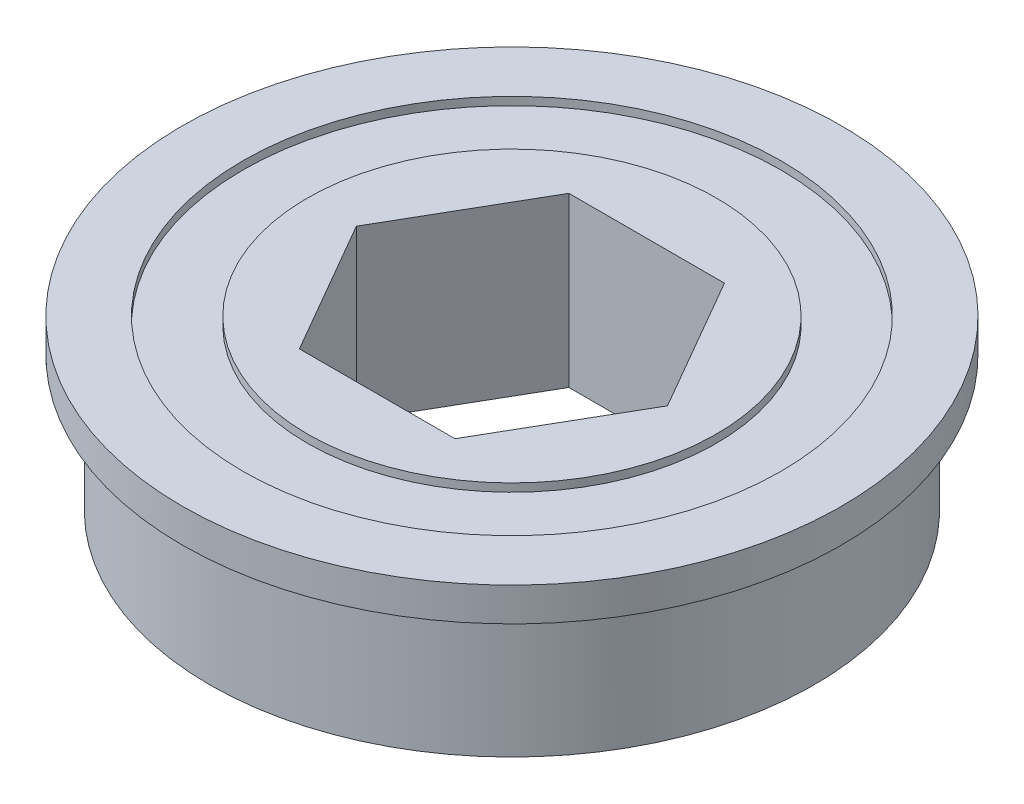
ISO-10303-21;
HEADER;
FILE_DESCRIPTION(('STEP AP214'),'2;1');
FILE_NAME('part.step','',(''),(''),'','','');
FILE_SCHEMA(('AUTOMOTIVE_DESIGN { 1 0 10303 214 1 1 1 1 }'));
ENDSEC;
DATA;
#1=APPLICATION_CONTEXT('core data for automotive mechanical design processes');
#2=APPLICATION_PROTOCOL_DEFINITION('international standard','automotive_design',2000,#1);
#3=PRODUCT_CONTEXT('',#1,'mechanical');
#4=PRODUCT('Part','Part','',(#3));
#5=PRODUCT_RELATED_PRODUCT_CATEGORY('part','',(#4));
#6=PRODUCT_DEFINITION_FORMATION('','',#4);
#7=PRODUCT_DEFINITION_CONTEXT('part definition',#1,'design');
#8=PRODUCT_DEFINITION('design','',#6,#7);
#9=PRODUCT_DEFINITION_SHAPE('','',#8);
#10=(LENGTH_UNIT() NAMED_UNIT(*) SI_UNIT(.MILLI.,.METRE.));
#11=(NAMED_UNIT(*) PLANE_ANGLE_UNIT() SI_UNIT($,.RADIAN.));
#12=(NAMED_UNIT(*) SI_UNIT($,.STERADIAN.) SOLID_ANGLE_UNIT());
#13=UNCERTAINTY_MEASURE_WITH_UNIT(LENGTH_MEASURE(1.E-05),#10,'distance_accuracy_value','');
#14=(GEOMETRIC_REPRESENTATION_CONTEXT(3) GLOBAL_UNCERTAINTY_ASSIGNED_CONTEXT((#13)) GLOBAL_UNIT_ASSIGNED_CONTEXT((#10,
#11,#12)) REPRESENTATION_CONTEXT('',''));
#15=CARTESIAN_POINT('',(0.,0.,0.));
#16=DIRECTION('',(0.,0.,1.));
#17=DIRECTION('',(1.,0.,0.));
#18=AXIS2_PLACEMENT_3D('',#15,#16,#17);
#19=CARTESIAN_POINT('',(0.,0.,0.));
#20=DIRECTION('',(0.,1.,0.));
#21=DIRECTION('',(0.,0.,1.));
#22=AXIS2_PLACEMENT_3D('',#19,#20,#21);
#23=CYLINDRICAL_SURFACE('',#22,12.7);
#24=CARTESIAN_POINT('',(0.,0.381,0.));
#25=DIRECTION('',(0.,1.,0.));
#26=DIRECTION('',(0.,0.,1.));
#27=AXIS2_PLACEMENT_3D('',#24,#25,#26);
#28=CIRCLE('',#27,12.7);
#29=CARTESIAN_POINT('',(0.,0.381,12.7));
#30=VERTEX_POINT('',#29);
#31=EDGE_CURVE('E147',#30,#30,#28,.F.);
#32=ORIENTED_EDGE('',*,*,#31,.F.);
#33=EDGE_LOOP('',(#32));
#34=FACE_BOUND('',#33,.T.);
#35=CARTESIAN_POINT('',(0.,0.,0.));
#36=DIRECTION('',(0.,1.,0.));
#37=DIRECTION('',(0.,0.,1.));
#38=AXIS2_PLACEMENT_3D('',#35,#36,#37);
#39=CIRCLE('',#38,12.7);
#40=CARTESIAN_POINT('',(0.,0.,12.7));
#41=VERTEX_POINT('',#40);
#42=EDGE_CURVE('E143',#41,#41,#39,.T.);
#43=ORIENTED_EDGE('',*,*,#42,.F.);
#44=EDGE_LOOP('',(#43));
#45=FACE_BOUND('',#44,.T.);
#46=ADVANCED_FACE('F18',(#34,#45),#23,.F.);
#47=CARTESIAN_POINT('',(9.652,0.381,0.));
#48=DIRECTION('',(0.,-1.,0.));
#49=DIRECTION('',(0.,0.,-1.));
#50=AXIS2_PLACEMENT_3D('',#47,#48,#49);
#51=PLANE('',#50);
#52=ORIENTED_EDGE('',*,*,#31,.T.);
#53=EDGE_LOOP('',(#52));
#54=FACE_BOUND('',#53,.T.);
#55=CARTESIAN_POINT('',(0.,0.381,0.));
#56=DIRECTION('',(0.,1.,0.));
#57=DIRECTION('',(0.,0.,1.));
#58=AXIS2_PLACEMENT_3D('',#55,#56,#57);
#59=CIRCLE('',#58,9.652);
#60=CARTESIAN_POINT('',(0.,0.381,9.652));
#61=VERTEX_POINT('',#60);
#62=EDGE_CURVE('E139',#61,#61,#59,.F.);
#63=ORIENTED_EDGE('',*,*,#62,.F.);
#64=EDGE_LOOP('',(#63));
#65=FACE_BOUND('',#64,.T.);
#66=ADVANCED_FACE('F393',(#54,#65),#51,.T.);
#67=CARTESIAN_POINT('',(14.2748,0.,0.));
#68=DIRECTION('',(0.,-1.,0.));
#69=DIRECTION('',(0.,0.,-1.));
#70=AXIS2_PLACEMENT_3D('',#67,#68,#69);
#71=PLANE('',#70);
#72=CARTESIAN_POINT('',(0.,0.,0.));
#73=DIRECTION('',(0.,1.,0.));
#74=DIRECTION('',(0.,0.,1.));
#75=AXIS2_PLACEMENT_3D('',#72,#73,#74);
#76=CIRCLE('',#75,14.2748);
#77=CARTESIAN_POINT('',(0.,0.,14.2748));
#78=VERTEX_POINT('',#77);
#79=EDGE_CURVE('E135',#78,#78,#76,.T.);
#80=ORIENTED_EDGE('',*,*,#79,.F.);
#81=EDGE_LOOP('',(#80));
#82=FACE_BOUND('',#81,.T.);
#83=ORIENTED_EDGE('',*,*,#42,.T.);
#84=EDGE_LOOP('',(#83));
#85=FACE_BOUND('',#84,.T.);
#86=ADVANCED_FACE('F383',(#82,#85),#71,.T.);
#87=CARTESIAN_POINT('',(0.,0.,0.));
#88=DIRECTION('',(0.,1.,0.));
#89=DIRECTION('',(0.,0.,1.));
#90=AXIS2_PLACEMENT_3D('',#87,#88,#89);
#91=CYLINDRICAL_SURFACE('',#90,9.652);
#92=CARTESIAN_POINT('',(0.,0.,0.));
#93=DIRECTION('',(0.,1.,0.));
#94=DIRECTION('',(0.,0.,1.));
#95=AXIS2_PLACEMENT_3D('',#92,#93,#94);
#96=CIRCLE('',#95,9.652);
#97=CARTESIAN_POINT('',(0.,0.,9.652));
#98=VERTEX_POINT('',#97);
#99=EDGE_CURVE('E109',#98,#98,#96,.F.);
#100=ORIENTED_EDGE('',*,*,#99,.F.);
#101=EDGE_LOOP('',(#100));
#102=FACE_BOUND('',#101,.T.);
#103=ORIENTED_EDGE('',*,*,#62,.T.);
#104=EDGE_LOOP('',(#103));
#105=FACE_BOUND('',#104,.T.);
#106=ADVANCED_FACE('F373',(#102,#105),#91,.T.);
#107=CARTESIAN_POINT('',(0.,0.,0.));
#108=DIRECTION('',(0.,1.,0.));
#109=DIRECTION('',(0.,0.,1.));
#110=AXIS2_PLACEMENT_3D('',#107,#108,#109);
#111=CYLINDRICAL_SURFACE('',#110,14.2748);
#112=ORIENTED_EDGE('',*,*,#79,.T.);
#113=EDGE_LOOP('',(#112));
#114=FACE_BOUND('',#113,.T.);
#115=CARTESIAN_POINT('',(0.,5.6,0.));
#116=DIRECTION('',(0.,-1.,0.));
#117=DIRECTION('',(0.,0.,-1.));
#118=AXIS2_PLACEMENT_3D('',#115,#116,#117);
#119=CIRCLE('',#118,14.2748);
#120=CARTESIAN_POINT('',(0.,5.6,-14.2748));
#121=VERTEX_POINT('',#120);
#122=EDGE_CURVE('E87',#121,#121,#119,.F.);
#123=ORIENTED_EDGE('',*,*,#122,.F.);
#124=EDGE_LOOP('',(#123));
#125=FACE_BOUND('',#124,.T.);
#126=ADVANCED_FACE('F363',(#114,#125),#111,.T.);
#127=CARTESIAN_POINT('',(9.652,0.,0.));
#128=DIRECTION('',(0.,-1.,0.));
#129=DIRECTION('',(0.,0.,-1.));
#130=AXIS2_PLACEMENT_3D('',#127,#128,#129);
#131=PLANE('',#130);
#132=ORIENTED_EDGE('',*,*,#99,.T.);
#133=EDGE_LOOP('',(#132));
#134=FACE_BOUND('',#133,.T.);
#135=DIRECTION('',(1.,0.,0.));
#136=VECTOR('',#135,1.);
#137=CARTESIAN_POINT('',(-3.67194771204601,0.,6.36));
#138=LINE('',#137,#136);
#139=CARTESIAN_POINT('',(-3.67194771204601,0.,6.36));
#140=VERTEX_POINT('',#139);
#141=CARTESIAN_POINT('',(3.67194771204602,0.,6.36));
#142=VERTEX_POINT('',#141);
#143=EDGE_CURVE('E64',#140,#142,#138,.T.);
#144=ORIENTED_EDGE('',*,*,#143,.T.);
#145=DIRECTION('',(0.5,0.,-0.866025403784439));
#146=VECTOR('',#145,1.);
#147=CARTESIAN_POINT('',(3.67194771204602,0.,6.36));
#148=LINE('',#147,#146);
#149=CARTESIAN_POINT('',(7.34389542409204,0.,0.));
#150=VERTEX_POINT('',#149);
#151=EDGE_CURVE('E66',#142,#150,#148,.T.);
#152=ORIENTED_EDGE('',*,*,#151,.T.);
#153=DIRECTION('',(-0.5,0.,-0.866025403784439));
#154=VECTOR('',#153,1.);
#155=CARTESIAN_POINT('',(7.34389542409204,0.,0.));
#156=LINE('',#155,#154);
#157=CARTESIAN_POINT('',(3.67194771204602,0.,-6.36));
#158=VERTEX_POINT('',#157);
#159=EDGE_CURVE('E69',#150,#158,#156,.T.);
#160=ORIENTED_EDGE('',*,*,#159,.T.);
#161=DIRECTION('',(-1.,0.,0.));
#162=VECTOR('',#161,1.);
#163=CARTESIAN_POINT('',(3.67194771204602,0.,-6.36));
#164=LINE('',#163,#162);
#165=CARTESIAN_POINT('',(-3.67194771204602,0.,-6.36));
#166=VERTEX_POINT('',#165);
#167=EDGE_CURVE('E220',#158,#166,#164,.T.);
#168=ORIENTED_EDGE('',*,*,#167,.T.);
#169=DIRECTION('',(-0.5,0.,0.866025403784439));
#170=VECTOR('',#169,1.);
#171=CARTESIAN_POINT('',(-3.67194771204602,0.,-6.36));
#172=LINE('',#171,#170);
#173=CARTESIAN_POINT('',(-7.34389542409204,0.,0.));
#174=VERTEX_POINT('',#173);
#175=EDGE_CURVE('E229',#166,#174,#172,.T.);
#176=ORIENTED_EDGE('',*,*,#175,.T.);
#177=DIRECTION('',(0.5,0.,0.866025403784439));
#178=VECTOR('',#177,1.);
#179=CARTESIAN_POINT('',(-7.34389542409204,0.,0.));
#180=LINE('',#179,#178);
#181=EDGE_CURVE('E236',#174,#140,#180,.T.);
#182=ORIENTED_EDGE('',*,*,#181,.T.);
#183=EDGE_LOOP('',(#144,#152,#160,#168,#176,#182));
#184=FACE_BOUND('',#183,.T.);
#185=ADVANCED_FACE('F68',(#134,#184),#131,.T.);
#186=CARTESIAN_POINT('',(0.,5.6,0.));
#187=DIRECTION('',(0.,-1.,0.));
#188=DIRECTION('',(0.,0.,-1.));
#189=AXIS2_PLACEMENT_3D('',#186,#187,#188);
#190=CONICAL_SURFACE('',#189,14.2748,0.523598775598298);
#191=CARTESIAN_POINT('',(0.,5.975,0.));
#192=DIRECTION('',(0.,1.,0.));
#193=DIRECTION('',(0.,0.,1.));
#194=AXIS2_PLACEMENT_3D('',#191,#192,#193);
#195=CIRCLE('',#194,14.0582936490539);
#196=CARTESIAN_POINT('',(0.,5.975,14.0582936490539));
#197=VERTEX_POINT('',#196);
#198=EDGE_CURVE('E101',#197,#197,#195,.F.);
#199=ORIENTED_EDGE('',*,*,#198,.T.);
#200=EDGE_LOOP('',(#199));
#201=FACE_BOUND('',#200,.T.);
#202=ORIENTED_EDGE('',*,*,#122,.T.);
#203=EDGE_LOOP('',(#202));
#204=FACE_BOUND('',#203,.T.);
#205=ADVANCED_FACE('F345',(#201,#204),#190,.T.);
#206=CARTESIAN_POINT('',(7.34389542409204,0.,0.));
#207=DIRECTION('',(0.866025403784439,0.,-0.5));
#208=DIRECTION('',(-0.5,0.,-0.866025403784439));
#209=AXIS2_PLACEMENT_3D('',#206,#207,#208);
#210=PLANE('',#209);
#211=DIRECTION('',(0.,1.,0.));
#212=VECTOR('',#211,1.);
#213=CARTESIAN_POINT('',(3.67194771204602,0.,-6.36));
#214=LINE('',#213,#212);
#215=CARTESIAN_POINT('',(3.67194771204602,7.9375,-6.36));
#216=VERTEX_POINT('',#215);
#217=EDGE_CURVE('E84',#216,#158,#214,.F.);
#218=ORIENTED_EDGE('',*,*,#217,.T.);
#219=ORIENTED_EDGE('',*,*,#159,.F.);
#220=DIRECTION('',(0.,1.,0.));
#221=VECTOR('',#220,1.);
#222=CARTESIAN_POINT('',(7.34389542409204,0.,0.));
#223=LINE('',#222,#221);
#224=CARTESIAN_POINT('',(7.34389542409204,7.9375,0.));
#225=VERTEX_POINT('',#224);
#226=EDGE_CURVE('E76',#150,#225,#223,.T.);
#227=ORIENTED_EDGE('',*,*,#226,.T.);
#228=DIRECTION('',(0.5,0.,0.866025403784438));
#229=VECTOR('',#228,1.);
#230=CARTESIAN_POINT('',(3.67194771204602,7.9375,-6.36));
#231=LINE('',#230,#229);
#232=EDGE_CURVE('E105',#216,#225,#231,.T.);
#233=ORIENTED_EDGE('',*,*,#232,.F.);
#234=EDGE_LOOP('',(#218,#219,#227,#233));
#235=FACE_BOUND('',#234,.T.);
#236=ADVANCED_FACE('F80',(#235),#210,.F.);
#237=CARTESIAN_POINT('',(3.67194771204602,0.,6.36));
#238=DIRECTION('',(0.866025403784439,0.,0.5));
#239=DIRECTION('',(0.5,0.,-0.866025403784439));
#240=AXIS2_PLACEMENT_3D('',#237,#238,#239);
#241=PLANE('',#240);
#242=ORIENTED_EDGE('',*,*,#226,.F.);
#243=ORIENTED_EDGE('',*,*,#151,.F.);
#244=DIRECTION('',(0.,1.,0.));
#245=VECTOR('',#244,1.);
#246=CARTESIAN_POINT('',(3.67194771204602,0.,6.36));
#247=LINE('',#246,#245);
#248=CARTESIAN_POINT('',(3.67194771204602,7.9375,6.36));
#249=VERTEX_POINT('',#248);
#250=EDGE_CURVE('E97',#142,#249,#247,.T.);
#251=ORIENTED_EDGE('',*,*,#250,.T.);
#252=DIRECTION('',(-0.5,0.,0.866025403784439));
#253=VECTOR('',#252,1.);
#254=CARTESIAN_POINT('',(7.34389542409204,7.9375,0.));
#255=LINE('',#254,#253);
#256=EDGE_CURVE('E91',#225,#249,#255,.T.);
#257=ORIENTED_EDGE('',*,*,#256,.F.);
#258=EDGE_LOOP('',(#242,#243,#251,#257));
#259=FACE_BOUND('',#258,.T.);
#260=ADVANCED_FACE('F89',(#259),#241,.F.);
#261=CARTESIAN_POINT('',(-3.67194771204601,0.,6.36));
#262=DIRECTION('',(0.,0.,1.));
#263=DIRECTION('',(1.,0.,0.));
#264=AXIS2_PLACEMENT_3D('',#261,#262,#263);
#265=PLANE('',#264);
#266=ORIENTED_EDGE('',*,*,#250,.F.);
#267=ORIENTED_EDGE('',*,*,#143,.F.);
#268=DIRECTION('',(0.,1.,0.));
#269=VECTOR('',#268,1.);
#270=CARTESIAN_POINT('',(-3.67194771204601,0.,6.36));
#271=LINE('',#270,#269);
#272=CARTESIAN_POINT('',(-3.67194771204601,7.9375,6.36));
#273=VERTEX_POINT('',#272);
#274=EDGE_CURVE('E232',#140,#273,#271,.T.);
#275=ORIENTED_EDGE('',*,*,#274,.T.);
#276=DIRECTION('',(1.,0.,0.));
#277=VECTOR('',#276,1.);
#278=CARTESIAN_POINT('',(6.35,7.9375,6.36));
#279=LINE('',#278,#277);
#280=EDGE_CURVE('E209',#249,#273,#279,.F.);
#281=ORIENTED_EDGE('',*,*,#280,.F.);
#282=EDGE_LOOP('',(#266,#267,#275,#281));
#283=FACE_BOUND('',#282,.T.);
#284=ADVANCED_FACE('F244',(#283),#265,.F.);
#285=CARTESIAN_POINT('',(-7.34389542409204,0.,0.));
#286=DIRECTION('',(-0.866025403784439,0.,0.5));
#287=DIRECTION('',(0.5,0.,0.866025403784439));
#288=AXIS2_PLACEMENT_3D('',#285,#286,#287);
#289=PLANE('',#288);
#290=ORIENTED_EDGE('',*,*,#274,.F.);
#291=ORIENTED_EDGE('',*,*,#181,.F.);
#292=DIRECTION('',(0.,1.,0.));
#293=VECTOR('',#292,1.);
#294=CARTESIAN_POINT('',(-7.34389542409204,0.,0.));
#295=LINE('',#294,#293);
#296=CARTESIAN_POINT('',(-7.34389542409204,7.9375,0.));
#297=VERTEX_POINT('',#296);
#298=EDGE_CURVE('E225',#174,#297,#295,.T.);
#299=ORIENTED_EDGE('',*,*,#298,.T.);
#300=DIRECTION('',(-0.5,0.,-0.866025403784439));
#301=VECTOR('',#300,1.);
#302=CARTESIAN_POINT('',(-3.67194771204601,7.9375,6.36));
#303=LINE('',#302,#301);
#304=EDGE_CURVE('E205',#273,#297,#303,.T.);
#305=ORIENTED_EDGE('',*,*,#304,.F.);
#306=EDGE_LOOP('',(#290,#291,#299,#305));
#307=FACE_BOUND('',#306,.T.);
#308=ADVANCED_FACE('F260',(#307),#289,.F.);
#309=CARTESIAN_POINT('',(-3.67194771204602,0.,-6.36));
#310=DIRECTION('',(-0.866025403784439,0.,-0.5));
#311=DIRECTION('',(-0.5,0.,0.866025403784439));
#312=AXIS2_PLACEMENT_3D('',#309,#310,#311);
#313=PLANE('',#312);
#314=ORIENTED_EDGE('',*,*,#298,.F.);
#315=ORIENTED_EDGE('',*,*,#175,.F.);
#316=DIRECTION('',(0.,1.,0.));
#317=VECTOR('',#316,1.);
#318=CARTESIAN_POINT('',(-3.67194771204602,0.,-6.36));
#319=LINE('',#318,#317);
#320=CARTESIAN_POINT('',(-3.67194771204602,7.9375,-6.36));
#321=VERTEX_POINT('',#320);
#322=EDGE_CURVE('E106',#166,#321,#319,.T.);
#323=ORIENTED_EDGE('',*,*,#322,.T.);
#324=DIRECTION('',(0.5,0.,-0.866025403784439));
#325=VECTOR('',#324,1.);
#326=CARTESIAN_POINT('',(-7.34389542409204,7.9375,0.));
#327=LINE('',#326,#325);
#328=EDGE_CURVE('E201',#297,#321,#327,.T.);
#329=ORIENTED_EDGE('',*,*,#328,.F.);
#330=EDGE_LOOP('',(#314,#315,#323,#329));
#331=FACE_BOUND('',#330,.T.);
#332=ADVANCED_FACE('F256',(#331),#313,.F.);
#333=CARTESIAN_POINT('',(3.67194771204602,0.,-6.36));
#334=DIRECTION('',(0.,0.,-1.));
#335=DIRECTION('',(-1.,0.,0.));
#336=AXIS2_PLACEMENT_3D('',#333,#334,#335);
#337=PLANE('',#336);
#338=ORIENTED_EDGE('',*,*,#322,.F.);
#339=ORIENTED_EDGE('',*,*,#167,.F.);
#340=ORIENTED_EDGE('',*,*,#217,.F.);
#341=DIRECTION('',(1.,0.,0.));
#342=VECTOR('',#341,1.);
#343=CARTESIAN_POINT('',(6.35,7.9375,-6.36));
#344=LINE('',#343,#342);
#345=EDGE_CURVE('E131',#321,#216,#344,.T.);
#346=ORIENTED_EDGE('',*,*,#345,.F.);
#347=EDGE_LOOP('',(#338,#339,#340,#346));
#348=FACE_BOUND('',#347,.T.);
#349=ADVANCED_FACE('F251',(#348),#337,.F.);
#350=CARTESIAN_POINT('',(6.35,7.9375,0.));
#351=DIRECTION('',(0.,1.,0.));
#352=DIRECTION('',(0.,0.,1.));
#353=AXIS2_PLACEMENT_3D('',#350,#351,#352);
#354=PLANE('',#353);
#355=CARTESIAN_POINT('',(0.,7.9375,0.));
#356=DIRECTION('',(0.,1.,0.));
#357=DIRECTION('',(0.,0.,1.));
#358=AXIS2_PLACEMENT_3D('',#355,#356,#357);
#359=CIRCLE('',#358,9.652);
#360=CARTESIAN_POINT('',(0.,7.9375,9.652));
#361=VERTEX_POINT('',#360);
#362=EDGE_CURVE('E126',#361,#361,#359,.F.);
#363=ORIENTED_EDGE('',*,*,#362,.F.);
#364=EDGE_LOOP('',(#363));
#365=FACE_BOUND('',#364,.T.);
#366=ORIENTED_EDGE('',*,*,#328,.T.);
#367=ORIENTED_EDGE('',*,*,#345,.T.);
#368=ORIENTED_EDGE('',*,*,#232,.T.);
#369=ORIENTED_EDGE('',*,*,#256,.T.);
#370=ORIENTED_EDGE('',*,*,#280,.T.);
#371=ORIENTED_EDGE('',*,*,#304,.T.);
#372=EDGE_LOOP('',(#366,#367,#368,#369,#370,#371));
#373=FACE_BOUND('',#372,.T.);
#374=ADVANCED_FACE('F185',(#365,#373),#354,.T.);
#375=CARTESIAN_POINT('',(0.,6.1,0.));
#376=DIRECTION('',(0.,1.,0.));
#377=DIRECTION('',(0.,0.,1.));
#378=AXIS2_PLACEMENT_3D('',#375,#376,#377);
#379=TOROIDAL_SURFACE('',#378,14.2748,0.25);
#380=ORIENTED_EDGE('',*,*,#198,.F.);
#381=EDGE_LOOP('',(#380));
#382=FACE_BOUND('',#381,.T.);
#383=CARTESIAN_POINT('',(0.,6.35,0.));
#384=DIRECTION('',(0.,-1.,0.));
#385=DIRECTION('',(0.,0.,-1.));
#386=AXIS2_PLACEMENT_3D('',#383,#384,#385);
#387=CIRCLE('',#386,14.2748);
#388=CARTESIAN_POINT('',(0.,6.35,14.2748));
#389=VERTEX_POINT('',#388);
#390=CARTESIAN_POINT('',(0.,6.35,-14.2748));
#391=VERTEX_POINT('',#390);
#392=EDGE_CURVE('E130',#389,#391,#387,.F.);
#393=ORIENTED_EDGE('',*,*,#392,.F.);
#394=CARTESIAN_POINT('',(0.,6.35,0.));
#395=DIRECTION('',(0.,-1.,0.));
#396=DIRECTION('',(0.,0.,1.));
#397=AXIS2_PLACEMENT_3D('',#394,#395,#396);
#398=CIRCLE('',#397,14.2748);
#399=EDGE_CURVE('E38',#391,#389,#398,.F.);
#400=ORIENTED_EDGE('',*,*,#399,.F.);
#401=EDGE_LOOP('',(#393,#400));
#402=FACE_BOUND('',#401,.T.);
#403=ADVANCED_FACE('F150',(#382,#402),#379,.F.);
#404=CARTESIAN_POINT('',(0.,0.,0.));
#405=DIRECTION('',(0.,1.,0.));
#406=DIRECTION('',(0.,0.,1.));
#407=AXIS2_PLACEMENT_3D('',#404,#405,#406);
#408=CYLINDRICAL_SURFACE('',#407,9.652);
#409=CARTESIAN_POINT('',(0.,7.5565,0.));
#410=DIRECTION('',(0.,1.,0.));
#411=DIRECTION('',(0.,0.,1.));
#412=AXIS2_PLACEMENT_3D('',#409,#410,#411);
#413=CIRCLE('',#412,9.652);
#414=CARTESIAN_POINT('',(0.,7.5565,9.652));
#415=VERTEX_POINT('',#414);
#416=EDGE_CURVE('E122',#415,#415,#413,.F.);
#417=ORIENTED_EDGE('',*,*,#416,.F.);
#418=EDGE_LOOP('',(#417));
#419=FACE_BOUND('',#418,.T.);
#420=ORIENTED_EDGE('',*,*,#362,.T.);
#421=EDGE_LOOP('',(#420));
#422=FACE_BOUND('',#421,.T.);
#423=ADVANCED_FACE('F176',(#419,#422),#408,.T.);
#424=CARTESIAN_POINT('',(15.5575,6.35,0.));
#425=DIRECTION('',(0.,-1.,0.));
#426=DIRECTION('',(0.,0.,-1.));
#427=AXIS2_PLACEMENT_3D('',#424,#425,#426);
#428=PLANE('',#427);
#429=CARTESIAN_POINT('',(0.,6.35,0.));
#430=DIRECTION('',(0.,1.,0.));
#431=DIRECTION('',(0.,0.,1.));
#432=AXIS2_PLACEMENT_3D('',#429,#430,#431);
#433=CIRCLE('',#432,15.5575);
#434=CARTESIAN_POINT('',(0.,6.35,15.5575));
#435=VERTEX_POINT('',#434);
#436=EDGE_CURVE('E118',#435,#435,#433,.T.);
#437=ORIENTED_EDGE('',*,*,#436,.F.);
#438=EDGE_LOOP('',(#437));
#439=FACE_BOUND('',#438,.T.);
#440=ORIENTED_EDGE('',*,*,#392,.T.);
#441=ORIENTED_EDGE('',*,*,#399,.T.);
#442=EDGE_LOOP('',(#440,#441));
#443=FACE_BOUND('',#442,.T.);
#444=ADVANCED_FACE('F155',(#439,#443),#428,.T.);
#445=CARTESIAN_POINT('',(9.652,7.5565,0.));
#446=DIRECTION('',(0.,1.,0.));
#447=DIRECTION('',(0.,0.,1.));
#448=AXIS2_PLACEMENT_3D('',#445,#446,#447);
#449=PLANE('',#448);
#450=ORIENTED_EDGE('',*,*,#416,.T.);
#451=EDGE_LOOP('',(#450));
#452=FACE_BOUND('',#451,.T.);
#453=CARTESIAN_POINT('',(0.,7.5565,0.));
#454=DIRECTION('',(0.,1.,0.));
#455=DIRECTION('',(0.,0.,1.));
#456=AXIS2_PLACEMENT_3D('',#453,#454,#455);
#457=CIRCLE('',#456,12.7);
#458=CARTESIAN_POINT('',(0.,7.5565,12.7));
#459=VERTEX_POINT('',#458);
#460=EDGE_CURVE('E114',#459,#459,#457,.T.);
#461=ORIENTED_EDGE('',*,*,#460,.T.);
#462=EDGE_LOOP('',(#461));
#463=FACE_BOUND('',#462,.T.);
#464=ADVANCED_FACE('F175',(#452,#463),#449,.T.);
#465=CARTESIAN_POINT('',(0.,0.,0.));
#466=DIRECTION('',(0.,1.,0.));
#467=DIRECTION('',(0.,0.,1.));
#468=AXIS2_PLACEMENT_3D('',#465,#466,#467);
#469=CYLINDRICAL_SURFACE('',#468,15.5575);
#470=ORIENTED_EDGE('',*,*,#436,.T.);
#471=EDGE_LOOP('',(#470));
#472=FACE_BOUND('',#471,.T.);
#473=CARTESIAN_POINT('',(0.,7.9375,0.));
#474=DIRECTION('',(0.,1.,0.));
#475=DIRECTION('',(0.,0.,1.));
#476=AXIS2_PLACEMENT_3D('',#473,#474,#475);
#477=CIRCLE('',#476,15.5575);
#478=CARTESIAN_POINT('',(0.,7.9375,15.5575));
#479=VERTEX_POINT('',#478);
#480=EDGE_CURVE('E30',#479,#479,#477,.T.);
#481=ORIENTED_EDGE('',*,*,#480,.F.);
#482=EDGE_LOOP('',(#481));
#483=FACE_BOUND('',#482,.T.);
#484=ADVANCED_FACE('F281',(#472,#483),#469,.T.);
#485=CARTESIAN_POINT('',(0.,0.,0.));
#486=DIRECTION('',(0.,1.,0.));
#487=DIRECTION('',(0.,0.,1.));
#488=AXIS2_PLACEMENT_3D('',#485,#486,#487);
#489=CYLINDRICAL_SURFACE('',#488,12.7);
#490=CARTESIAN_POINT('',(0.,7.9375,0.));
#491=DIRECTION('',(0.,1.,0.));
#492=DIRECTION('',(0.,0.,1.));
#493=AXIS2_PLACEMENT_3D('',#490,#491,#492);
#494=CIRCLE('',#493,12.7);
#495=CARTESIAN_POINT('',(0.,7.9375,12.7));
#496=VERTEX_POINT('',#495);
#497=EDGE_CURVE('E11',#496,#496,#494,.F.);
#498=ORIENTED_EDGE('',*,*,#497,.F.);
#499=EDGE_LOOP('',(#498));
#500=FACE_BOUND('',#499,.T.);
#501=ORIENTED_EDGE('',*,*,#460,.F.);
#502=EDGE_LOOP('',(#501));
#503=FACE_BOUND('',#502,.T.);
#504=ADVANCED_FACE('F275',(#500,#503),#489,.F.);
#505=CARTESIAN_POINT('',(12.7,7.9375,0.));
#506=DIRECTION('',(0.,1.,0.));
#507=DIRECTION('',(0.,0.,1.));
#508=AXIS2_PLACEMENT_3D('',#505,#506,#507);
#509=PLANE('',#508);
#510=ORIENTED_EDGE('',*,*,#497,.T.);
#511=EDGE_LOOP('',(#510));
#512=FACE_BOUND('',#511,.T.);
#513=ORIENTED_EDGE('',*,*,#480,.T.);
#514=EDGE_LOOP('',(#513));
#515=FACE_BOUND('',#514,.T.);
#516=ADVANCED_FACE('F273',(#512,#515),#509,.T.);
#517=CLOSED_SHELL('',(#46,#66,#86,#106,#126,#185,#205,#236,#260,#284,#308,#332,#349,#374,#403,
#423,#444,#464,#484,#504,#516));
#518=MANIFOLD_SOLID_BREP('B1',#517);
#519=ADVANCED_BREP_SHAPE_REPRESENTATION('',(#18,#518),#14);
#520=SHAPE_DEFINITION_REPRESENTATION(#9,#519);
ENDSEC;
END-ISO-10303-21;
